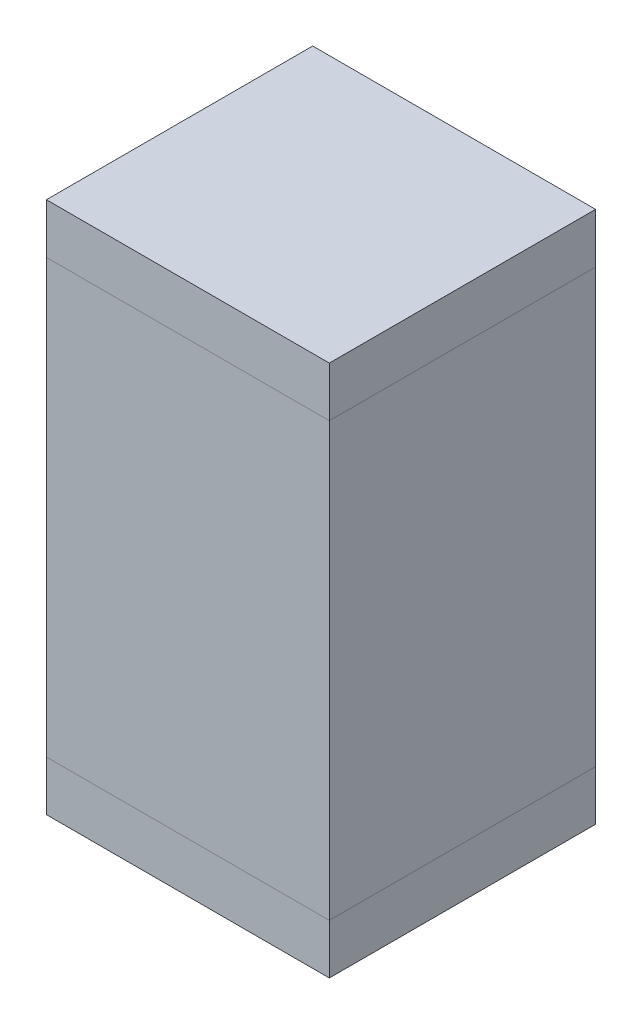
ISO-10303-21;
HEADER;
FILE_DESCRIPTION(('STEP AP214'),'2;1');
FILE_NAME('part.step','',(''),(''),'','','');
FILE_SCHEMA(('AUTOMOTIVE_DESIGN { 1 0 10303 214 1 1 1 1 }'));
ENDSEC;
DATA;
#1=APPLICATION_CONTEXT('core data for automotive mechanical design processes');
#2=APPLICATION_PROTOCOL_DEFINITION('international standard','automotive_design',2000,#1);
#3=PRODUCT_CONTEXT('',#1,'mechanical');
#4=PRODUCT('Part','Part','',(#3));
#5=PRODUCT_RELATED_PRODUCT_CATEGORY('part','',(#4));
#6=PRODUCT_DEFINITION_FORMATION('','',#4);
#7=PRODUCT_DEFINITION_CONTEXT('part definition',#1,'design');
#8=PRODUCT_DEFINITION('design','',#6,#7);
#9=PRODUCT_DEFINITION_SHAPE('','',#8);
#10=(LENGTH_UNIT() NAMED_UNIT(*) SI_UNIT(.MILLI.,.METRE.));
#11=(NAMED_UNIT(*) PLANE_ANGLE_UNIT() SI_UNIT($,.RADIAN.));
#12=(NAMED_UNIT(*) SI_UNIT($,.STERADIAN.) SOLID_ANGLE_UNIT());
#13=UNCERTAINTY_MEASURE_WITH_UNIT(LENGTH_MEASURE(1.E-05),#10,'distance_accuracy_value','');
#14=(GEOMETRIC_REPRESENTATION_CONTEXT(3) GLOBAL_UNCERTAINTY_ASSIGNED_CONTEXT((#13)) GLOBAL_UNIT_ASSIGNED_CONTEXT((#10,
#11,#12)) REPRESENTATION_CONTEXT('',''));
#15=CARTESIAN_POINT('',(0.,0.,0.));
#16=DIRECTION('',(0.,0.,1.));
#17=DIRECTION('',(1.,0.,0.));
#18=AXIS2_PLACEMENT_3D('',#15,#16,#17);
#19=CARTESIAN_POINT('',(0.,0.,0.));
#20=DIRECTION('',(0.,0.,1.));
#21=DIRECTION('',(1.,0.,0.));
#22=AXIS2_PLACEMENT_3D('',#19,#20,#21);
#23=PLANE('',#22);
#24=DIRECTION('',(1.,0.,0.));
#25=VECTOR('',#24,1.);
#26=CARTESIAN_POINT('',(-0.425,0.65,0.));
#27=LINE('',#26,#25);
#28=CARTESIAN_POINT('',(-0.425,0.65,0.));
#29=VERTEX_POINT('',#28);
#30=CARTESIAN_POINT('',(0.425,0.65,0.));
#31=VERTEX_POINT('',#30);
#32=EDGE_CURVE('P0_E26',#29,#31,#27,.T.);
#33=ORIENTED_EDGE('',*,*,#32,.T.);
#34=DIRECTION('',(0.,-1.,0.));
#35=VECTOR('',#34,1.);
#36=CARTESIAN_POINT('',(0.425,0.65,0.));
#37=LINE('',#36,#35);
#38=CARTESIAN_POINT('',(0.425,-0.65,0.));
#39=VERTEX_POINT('',#38);
#40=EDGE_CURVE('P0_E78',#31,#39,#37,.T.);
#41=ORIENTED_EDGE('',*,*,#40,.T.);
#42=DIRECTION('',(-1.,0.,0.));
#43=VECTOR('',#42,1.);
#44=CARTESIAN_POINT('',(0.425,-0.65,0.));
#45=LINE('',#44,#43);
#46=CARTESIAN_POINT('',(-0.425,-0.65,0.));
#47=VERTEX_POINT('',#46);
#48=EDGE_CURVE('P0_E106',#39,#47,#45,.T.);
#49=ORIENTED_EDGE('',*,*,#48,.T.);
#50=DIRECTION('',(0.,1.,0.));
#51=VECTOR('',#50,1.);
#52=CARTESIAN_POINT('',(-0.425,-0.65,0.));
#53=LINE('',#52,#51);
#54=EDGE_CURVE('P0_E53',#47,#29,#53,.T.);
#55=ORIENTED_EDGE('',*,*,#54,.T.);
#56=EDGE_LOOP('',(#33,#41,#49,#55));
#57=FACE_BOUND('',#56,.T.);
#58=ADVANCED_FACE('P0_F17',(#57),#23,.F.);
#59=CARTESIAN_POINT('',(0.,0.,0.8));
#60=DIRECTION('',(0.,0.,1.));
#61=DIRECTION('',(1.,0.,0.));
#62=AXIS2_PLACEMENT_3D('',#59,#60,#61);
#63=PLANE('',#62);
#64=DIRECTION('',(-1.,0.,0.));
#65=VECTOR('',#64,1.);
#66=CARTESIAN_POINT('',(-0.425,0.65,0.8));
#67=LINE('',#66,#65);
#68=CARTESIAN_POINT('',(0.425,0.65,0.8));
#69=VERTEX_POINT('',#68);
#70=CARTESIAN_POINT('',(-0.425,0.65,0.8));
#71=VERTEX_POINT('',#70);
#72=EDGE_CURVE('P0_E11',#69,#71,#67,.T.);
#73=ORIENTED_EDGE('',*,*,#72,.T.);
#74=DIRECTION('',(0.,-1.,0.));
#75=VECTOR('',#74,1.);
#76=CARTESIAN_POINT('',(-0.425,-0.65,0.8));
#77=LINE('',#76,#75);
#78=CARTESIAN_POINT('',(-0.425,-0.65,0.8));
#79=VERTEX_POINT('',#78);
#80=EDGE_CURVE('P0_E100',#71,#79,#77,.T.);
#81=ORIENTED_EDGE('',*,*,#80,.T.);
#82=DIRECTION('',(1.,0.,0.));
#83=VECTOR('',#82,1.);
#84=CARTESIAN_POINT('',(0.425,-0.65,0.8));
#85=LINE('',#84,#83);
#86=CARTESIAN_POINT('',(0.425,-0.65,0.8));
#87=VERTEX_POINT('',#86);
#88=EDGE_CURVE('P0_E60',#79,#87,#85,.T.);
#89=ORIENTED_EDGE('',*,*,#88,.T.);
#90=DIRECTION('',(0.,1.,0.));
#91=VECTOR('',#90,1.);
#92=CARTESIAN_POINT('',(0.425,0.65,0.8));
#93=LINE('',#92,#91);
#94=EDGE_CURVE('P0_E87',#87,#69,#93,.T.);
#95=ORIENTED_EDGE('',*,*,#94,.T.);
#96=EDGE_LOOP('',(#73,#81,#89,#95));
#97=FACE_BOUND('',#96,.T.);
#98=ADVANCED_FACE('P0_F117',(#97),#63,.T.);
#99=CARTESIAN_POINT('',(0.425,0.65,0.));
#100=DIRECTION('',(0.,1.,0.));
#101=DIRECTION('',(1.,0.,0.));
#102=AXIS2_PLACEMENT_3D('',#99,#100,#101);
#103=PLANE('',#102);
#104=ORIENTED_EDGE('',*,*,#32,.F.);
#105=DIRECTION('',(0.,0.,1.));
#106=VECTOR('',#105,1.);
#107=CARTESIAN_POINT('',(-0.425,0.65,0.));
#108=LINE('',#107,#106);
#109=EDGE_CURVE('P0_E80',#29,#71,#108,.T.);
#110=ORIENTED_EDGE('',*,*,#109,.T.);
#111=ORIENTED_EDGE('',*,*,#72,.F.);
#112=DIRECTION('',(0.,0.,1.));
#113=VECTOR('',#112,1.);
#114=CARTESIAN_POINT('',(0.425,0.65,0.));
#115=LINE('',#114,#113);
#116=EDGE_CURVE('P0_E82',#31,#69,#115,.T.);
#117=ORIENTED_EDGE('',*,*,#116,.F.);
#118=EDGE_LOOP('',(#104,#110,#111,#117));
#119=FACE_BOUND('',#118,.T.);
#120=ADVANCED_FACE('P0_F83',(#119),#103,.T.);
#121=CARTESIAN_POINT('',(-0.425,0.65,0.));
#122=DIRECTION('',(-1.,0.,0.));
#123=DIRECTION('',(0.,0.,1.));
#124=AXIS2_PLACEMENT_3D('',#121,#122,#123);
#125=PLANE('',#124);
#126=ORIENTED_EDGE('',*,*,#54,.F.);
#127=DIRECTION('',(0.,0.,1.));
#128=VECTOR('',#127,1.);
#129=CARTESIAN_POINT('',(-0.425,-0.65,0.));
#130=LINE('',#129,#128);
#131=EDGE_CURVE('P0_E101',#47,#79,#130,.T.);
#132=ORIENTED_EDGE('',*,*,#131,.T.);
#133=ORIENTED_EDGE('',*,*,#80,.F.);
#134=ORIENTED_EDGE('',*,*,#109,.F.);
#135=EDGE_LOOP('',(#126,#132,#133,#134));
#136=FACE_BOUND('',#135,.T.);
#137=ADVANCED_FACE('P0_F116',(#136),#125,.T.);
#138=CARTESIAN_POINT('',(-0.425,-0.65,0.));
#139=DIRECTION('',(0.,-1.,0.));
#140=DIRECTION('',(0.,0.,-1.));
#141=AXIS2_PLACEMENT_3D('',#138,#139,#140);
#142=PLANE('',#141);
#143=ORIENTED_EDGE('',*,*,#48,.F.);
#144=DIRECTION('',(0.,0.,1.));
#145=VECTOR('',#144,1.);
#146=CARTESIAN_POINT('',(0.425,-0.65,0.));
#147=LINE('',#146,#145);
#148=EDGE_CURVE('P0_E91',#39,#87,#147,.T.);
#149=ORIENTED_EDGE('',*,*,#148,.T.);
#150=ORIENTED_EDGE('',*,*,#88,.F.);
#151=ORIENTED_EDGE('',*,*,#131,.F.);
#152=EDGE_LOOP('',(#143,#149,#150,#151));
#153=FACE_BOUND('',#152,.T.);
#154=ADVANCED_FACE('P0_F128',(#153),#142,.T.);
#155=CARTESIAN_POINT('',(0.425,-0.65,0.));
#156=DIRECTION('',(1.,0.,0.));
#157=DIRECTION('',(0.,1.,0.));
#158=AXIS2_PLACEMENT_3D('',#155,#156,#157);
#159=PLANE('',#158);
#160=ORIENTED_EDGE('',*,*,#40,.F.);
#161=ORIENTED_EDGE('',*,*,#116,.T.);
#162=ORIENTED_EDGE('',*,*,#94,.F.);
#163=ORIENTED_EDGE('',*,*,#148,.F.);
#164=EDGE_LOOP('',(#160,#161,#162,#163));
#165=FACE_BOUND('',#164,.T.);
#166=ADVANCED_FACE('P0_F90',(#165),#159,.T.);
#167=CLOSED_SHELL('',(#58,#98,#120,#137,#154,#166));
#168=MANIFOLD_SOLID_BREP('P0_B1',#167);
#169=CARTESIAN_POINT('',(0.425,0.65,0.));
#170=DIRECTION('',(0.,1.,0.));
#171=DIRECTION('',(1.,0.,0.));
#172=AXIS2_PLACEMENT_3D('',#169,#170,#171);
#173=PLANE('',#172);
#174=DIRECTION('',(1.,0.,0.));
#175=VECTOR('',#174,1.);
#176=CARTESIAN_POINT('',(-0.425,0.65,0.));
#177=LINE('',#176,#175);
#178=CARTESIAN_POINT('',(-0.425,0.65,0.));
#179=VERTEX_POINT('',#178);
#180=CARTESIAN_POINT('',(0.425,0.65,0.));
#181=VERTEX_POINT('',#180);
#182=EDGE_CURVE('P1_E26',#179,#181,#177,.T.);
#183=ORIENTED_EDGE('',*,*,#182,.T.);
#184=DIRECTION('',(0.,0.,1.));
#185=VECTOR('',#184,1.);
#186=CARTESIAN_POINT('',(0.425,0.65,0.));
#187=LINE('',#186,#185);
#188=CARTESIAN_POINT('',(0.425,0.65,0.8));
#189=VERTEX_POINT('',#188);
#190=EDGE_CURVE('P1_E106',#181,#189,#187,.T.);
#191=ORIENTED_EDGE('',*,*,#190,.T.);
#192=DIRECTION('',(-1.,0.,0.));
#193=VECTOR('',#192,1.);
#194=CARTESIAN_POINT('',(-0.425,0.65,0.8));
#195=LINE('',#194,#193);
#196=CARTESIAN_POINT('',(-0.425,0.65,0.8));
#197=VERTEX_POINT('',#196);
#198=EDGE_CURVE('P1_E85',#189,#197,#195,.T.);
#199=ORIENTED_EDGE('',*,*,#198,.T.);
#200=DIRECTION('',(0.,0.,1.));
#201=VECTOR('',#200,1.);
#202=CARTESIAN_POINT('',(-0.425,0.65,0.));
#203=LINE('',#202,#201);
#204=EDGE_CURVE('P1_E60',#179,#197,#203,.T.);
#205=ORIENTED_EDGE('',*,*,#204,.F.);
#206=EDGE_LOOP('',(#183,#191,#199,#205));
#207=FACE_BOUND('',#206,.T.);
#208=ADVANCED_FACE('P1_F17',(#207),#173,.F.);
#209=CARTESIAN_POINT('',(0.425,0.8,0.));
#210=DIRECTION('',(0.,1.,0.));
#211=DIRECTION('',(1.,0.,0.));
#212=AXIS2_PLACEMENT_3D('',#209,#210,#211);
#213=PLANE('',#212);
#214=DIRECTION('',(-1.,0.,0.));
#215=VECTOR('',#214,1.);
#216=CARTESIAN_POINT('',(-0.425,0.8,0.));
#217=LINE('',#216,#215);
#218=CARTESIAN_POINT('',(0.425,0.8,0.));
#219=VERTEX_POINT('',#218);
#220=CARTESIAN_POINT('',(-0.425,0.8,0.));
#221=VERTEX_POINT('',#220);
#222=EDGE_CURVE('P1_E11',#219,#221,#217,.T.);
#223=ORIENTED_EDGE('',*,*,#222,.T.);
#224=DIRECTION('',(0.,0.,1.));
#225=VECTOR('',#224,1.);
#226=CARTESIAN_POINT('',(-0.425,0.8,0.));
#227=LINE('',#226,#225);
#228=CARTESIAN_POINT('',(-0.425,0.8,0.8));
#229=VERTEX_POINT('',#228);
#230=EDGE_CURVE('P1_E65',#221,#229,#227,.T.);
#231=ORIENTED_EDGE('',*,*,#230,.T.);
#232=DIRECTION('',(1.,0.,0.));
#233=VECTOR('',#232,1.);
#234=CARTESIAN_POINT('',(-0.425,0.8,0.8));
#235=LINE('',#234,#233);
#236=CARTESIAN_POINT('',(0.425,0.8,0.8));
#237=VERTEX_POINT('',#236);
#238=EDGE_CURVE('P1_E68',#229,#237,#235,.T.);
#239=ORIENTED_EDGE('',*,*,#238,.T.);
#240=DIRECTION('',(0.,0.,-1.));
#241=VECTOR('',#240,1.);
#242=CARTESIAN_POINT('',(0.425,0.8,0.));
#243=LINE('',#242,#241);
#244=EDGE_CURVE('P1_E110',#237,#219,#243,.T.);
#245=ORIENTED_EDGE('',*,*,#244,.T.);
#246=EDGE_LOOP('',(#223,#231,#239,#245));
#247=FACE_BOUND('',#246,.T.);
#248=ADVANCED_FACE('P1_F66',(#247),#213,.T.);
#249=CARTESIAN_POINT('',(0.425,0.65,0.));
#250=DIRECTION('',(0.,0.,-1.));
#251=DIRECTION('',(0.,-1.,0.));
#252=AXIS2_PLACEMENT_3D('',#249,#250,#251);
#253=PLANE('',#252);
#254=ORIENTED_EDGE('',*,*,#182,.F.);
#255=DIRECTION('',(0.,1.,0.));
#256=VECTOR('',#255,1.);
#257=CARTESIAN_POINT('',(-0.425,0.65,0.));
#258=LINE('',#257,#256);
#259=EDGE_CURVE('P1_E71',#179,#221,#258,.T.);
#260=ORIENTED_EDGE('',*,*,#259,.T.);
#261=ORIENTED_EDGE('',*,*,#222,.F.);
#262=DIRECTION('',(0.,1.,0.));
#263=VECTOR('',#262,1.);
#264=CARTESIAN_POINT('',(0.425,0.65,0.));
#265=LINE('',#264,#263);
#266=EDGE_CURVE('P1_E113',#181,#219,#265,.T.);
#267=ORIENTED_EDGE('',*,*,#266,.F.);
#268=EDGE_LOOP('',(#254,#260,#261,#267));
#269=FACE_BOUND('',#268,.T.);
#270=ADVANCED_FACE('P1_F100',(#269),#253,.T.);
#271=CARTESIAN_POINT('',(-0.425,0.65,0.));
#272=DIRECTION('',(-1.,0.,0.));
#273=DIRECTION('',(0.,0.,1.));
#274=AXIS2_PLACEMENT_3D('',#271,#272,#273);
#275=PLANE('',#274);
#276=ORIENTED_EDGE('',*,*,#204,.T.);
#277=DIRECTION('',(0.,1.,0.));
#278=VECTOR('',#277,1.);
#279=CARTESIAN_POINT('',(-0.425,0.65,0.8));
#280=LINE('',#279,#278);
#281=EDGE_CURVE('P1_E73',#197,#229,#280,.T.);
#282=ORIENTED_EDGE('',*,*,#281,.T.);
#283=ORIENTED_EDGE('',*,*,#230,.F.);
#284=ORIENTED_EDGE('',*,*,#259,.F.);
#285=EDGE_LOOP('',(#276,#282,#283,#284));
#286=FACE_BOUND('',#285,.T.);
#287=ADVANCED_FACE('P1_F74',(#286),#275,.T.);
#288=CARTESIAN_POINT('',(-0.425,0.65,0.8));
#289=DIRECTION('',(0.,0.,1.));
#290=DIRECTION('',(1.,0.,0.));
#291=AXIS2_PLACEMENT_3D('',#288,#289,#290);
#292=PLANE('',#291);
#293=ORIENTED_EDGE('',*,*,#198,.F.);
#294=DIRECTION('',(0.,1.,0.));
#295=VECTOR('',#294,1.);
#296=CARTESIAN_POINT('',(0.425,0.65,0.8));
#297=LINE('',#296,#295);
#298=EDGE_CURVE('P1_E82',#189,#237,#297,.T.);
#299=ORIENTED_EDGE('',*,*,#298,.T.);
#300=ORIENTED_EDGE('',*,*,#238,.F.);
#301=ORIENTED_EDGE('',*,*,#281,.F.);
#302=EDGE_LOOP('',(#293,#299,#300,#301));
#303=FACE_BOUND('',#302,.T.);
#304=ADVANCED_FACE('P1_F80',(#303),#292,.T.);
#305=CARTESIAN_POINT('',(0.425,0.65,0.8));
#306=DIRECTION('',(1.,0.,0.));
#307=DIRECTION('',(0.,1.,0.));
#308=AXIS2_PLACEMENT_3D('',#305,#306,#307);
#309=PLANE('',#308);
#310=ORIENTED_EDGE('',*,*,#190,.F.);
#311=ORIENTED_EDGE('',*,*,#266,.T.);
#312=ORIENTED_EDGE('',*,*,#244,.F.);
#313=ORIENTED_EDGE('',*,*,#298,.F.);
#314=EDGE_LOOP('',(#310,#311,#312,#313));
#315=FACE_BOUND('',#314,.T.);
#316=ADVANCED_FACE('P1_F108',(#315),#309,.T.);
#317=CLOSED_SHELL('',(#208,#248,#270,#287,#304,#316));
#318=MANIFOLD_SOLID_BREP('P1_B1',#317);
#319=CARTESIAN_POINT('',(-0.425,-0.65,0.));
#320=DIRECTION('',(0.,-1.,0.));
#321=DIRECTION('',(0.,0.,-1.));
#322=AXIS2_PLACEMENT_3D('',#319,#320,#321);
#323=PLANE('',#322);
#324=DIRECTION('',(-1.,0.,0.));
#325=VECTOR('',#324,1.);
#326=CARTESIAN_POINT('',(0.425,-0.65,0.));
#327=LINE('',#326,#325);
#328=CARTESIAN_POINT('',(0.425,-0.65,0.));
#329=VERTEX_POINT('',#328);
#330=CARTESIAN_POINT('',(-0.425,-0.65,0.));
#331=VERTEX_POINT('',#330);
#332=EDGE_CURVE('P2_E25',#329,#331,#327,.T.);
#333=ORIENTED_EDGE('',*,*,#332,.T.);
#334=DIRECTION('',(0.,0.,1.));
#335=VECTOR('',#334,1.);
#336=CARTESIAN_POINT('',(-0.425,-0.65,0.));
#337=LINE('',#336,#335);
#338=CARTESIAN_POINT('',(-0.425,-0.65,0.8));
#339=VERTEX_POINT('',#338);
#340=EDGE_CURVE('P2_E71',#331,#339,#337,.T.);
#341=ORIENTED_EDGE('',*,*,#340,.T.);
#342=DIRECTION('',(1.,0.,0.));
#343=VECTOR('',#342,1.);
#344=CARTESIAN_POINT('',(0.425,-0.65,0.8));
#345=LINE('',#344,#343);
#346=CARTESIAN_POINT('',(0.425,-0.65,0.8));
#347=VERTEX_POINT('',#346);
#348=EDGE_CURVE('P2_E92',#339,#347,#345,.T.);
#349=ORIENTED_EDGE('',*,*,#348,.T.);
#350=DIRECTION('',(0.,0.,1.));
#351=VECTOR('',#350,1.);
#352=CARTESIAN_POINT('',(0.425,-0.65,0.));
#353=LINE('',#352,#351);
#354=EDGE_CURVE('P2_E72',#329,#347,#353,.T.);
#355=ORIENTED_EDGE('',*,*,#354,.F.);
#356=EDGE_LOOP('',(#333,#341,#349,#355));
#357=FACE_BOUND('',#356,.T.);
#358=ADVANCED_FACE('P2_F17',(#357),#323,.F.);
#359=CARTESIAN_POINT('',(-0.425,-0.8,0.));
#360=DIRECTION('',(0.,-1.,0.));
#361=DIRECTION('',(0.,0.,-1.));
#362=AXIS2_PLACEMENT_3D('',#359,#360,#361);
#363=PLANE('',#362);
#364=DIRECTION('',(1.,0.,0.));
#365=VECTOR('',#364,1.);
#366=CARTESIAN_POINT('',(0.425,-0.8,0.));
#367=LINE('',#366,#365);
#368=CARTESIAN_POINT('',(-0.425,-0.8,0.));
#369=VERTEX_POINT('',#368);
#370=CARTESIAN_POINT('',(0.425,-0.8,0.));
#371=VERTEX_POINT('',#370);
#372=EDGE_CURVE('P2_E11',#369,#371,#367,.T.);
#373=ORIENTED_EDGE('',*,*,#372,.T.);
#374=DIRECTION('',(0.,0.,1.));
#375=VECTOR('',#374,1.);
#376=CARTESIAN_POINT('',(0.425,-0.8,0.));
#377=LINE('',#376,#375);
#378=CARTESIAN_POINT('',(0.425,-0.8,0.8));
#379=VERTEX_POINT('',#378);
#380=EDGE_CURVE('P2_E97',#371,#379,#377,.T.);
#381=ORIENTED_EDGE('',*,*,#380,.T.);
#382=DIRECTION('',(-1.,0.,0.));
#383=VECTOR('',#382,1.);
#384=CARTESIAN_POINT('',(0.425,-0.8,0.8));
#385=LINE('',#384,#383);
#386=CARTESIAN_POINT('',(-0.425,-0.8,0.8));
#387=VERTEX_POINT('',#386);
#388=EDGE_CURVE('P2_E93',#379,#387,#385,.T.);
#389=ORIENTED_EDGE('',*,*,#388,.T.);
#390=DIRECTION('',(0.,0.,-1.));
#391=VECTOR('',#390,1.);
#392=CARTESIAN_POINT('',(-0.425,-0.8,0.));
#393=LINE('',#392,#391);
#394=EDGE_CURVE('P2_E81',#387,#369,#393,.T.);
#395=ORIENTED_EDGE('',*,*,#394,.T.);
#396=EDGE_LOOP('',(#373,#381,#389,#395));
#397=FACE_BOUND('',#396,.T.);
#398=ADVANCED_FACE('P2_F117',(#397),#363,.T.);
#399=CARTESIAN_POINT('',(-0.425,-0.65,0.));
#400=DIRECTION('',(0.,0.,-1.));
#401=DIRECTION('',(0.,-1.,0.));
#402=AXIS2_PLACEMENT_3D('',#399,#400,#401);
#403=PLANE('',#402);
#404=ORIENTED_EDGE('',*,*,#332,.F.);
#405=DIRECTION('',(0.,-1.,0.));
#406=VECTOR('',#405,1.);
#407=CARTESIAN_POINT('',(0.425,-0.65,0.));
#408=LINE('',#407,#406);
#409=EDGE_CURVE('P2_E74',#329,#371,#408,.T.);
#410=ORIENTED_EDGE('',*,*,#409,.T.);
#411=ORIENTED_EDGE('',*,*,#372,.F.);
#412=DIRECTION('',(0.,-1.,0.));
#413=VECTOR('',#412,1.);
#414=CARTESIAN_POINT('',(-0.425,-0.65,0.));
#415=LINE('',#414,#413);
#416=EDGE_CURVE('P2_E76',#331,#369,#415,.T.);
#417=ORIENTED_EDGE('',*,*,#416,.F.);
#418=EDGE_LOOP('',(#404,#410,#411,#417));
#419=FACE_BOUND('',#418,.T.);
#420=ADVANCED_FACE('P2_F77',(#419),#403,.T.);
#421=CARTESIAN_POINT('',(0.425,-0.65,0.));
#422=DIRECTION('',(1.,0.,0.));
#423=DIRECTION('',(0.,1.,0.));
#424=AXIS2_PLACEMENT_3D('',#421,#422,#423);
#425=PLANE('',#424);
#426=ORIENTED_EDGE('',*,*,#354,.T.);
#427=DIRECTION('',(0.,-1.,0.));
#428=VECTOR('',#427,1.);
#429=CARTESIAN_POINT('',(0.425,-0.65,0.8));
#430=LINE('',#429,#428);
#431=EDGE_CURVE('P2_E102',#347,#379,#430,.T.);
#432=ORIENTED_EDGE('',*,*,#431,.T.);
#433=ORIENTED_EDGE('',*,*,#380,.F.);
#434=ORIENTED_EDGE('',*,*,#409,.F.);
#435=EDGE_LOOP('',(#426,#432,#433,#434));
#436=FACE_BOUND('',#435,.T.);
#437=ADVANCED_FACE('P2_F114',(#436),#425,.T.);
#438=CARTESIAN_POINT('',(0.425,-0.65,0.8));
#439=DIRECTION('',(0.,0.,1.));
#440=DIRECTION('',(1.,0.,0.));
#441=AXIS2_PLACEMENT_3D('',#438,#439,#440);
#442=PLANE('',#441);
#443=ORIENTED_EDGE('',*,*,#348,.F.);
#444=DIRECTION('',(0.,-1.,0.));
#445=VECTOR('',#444,1.);
#446=CARTESIAN_POINT('',(-0.425,-0.65,0.8));
#447=LINE('',#446,#445);
#448=EDGE_CURVE('P2_E86',#339,#387,#447,.T.);
#449=ORIENTED_EDGE('',*,*,#448,.T.);
#450=ORIENTED_EDGE('',*,*,#388,.F.);
#451=ORIENTED_EDGE('',*,*,#431,.F.);
#452=EDGE_LOOP('',(#443,#449,#450,#451));
#453=FACE_BOUND('',#452,.T.);
#454=ADVANCED_FACE('P2_F119',(#453),#442,.T.);
#455=CARTESIAN_POINT('',(-0.425,-0.65,0.8));
#456=DIRECTION('',(-1.,0.,0.));
#457=DIRECTION('',(0.,0.,1.));
#458=AXIS2_PLACEMENT_3D('',#455,#456,#457);
#459=PLANE('',#458);
#460=ORIENTED_EDGE('',*,*,#340,.F.);
#461=ORIENTED_EDGE('',*,*,#416,.T.);
#462=ORIENTED_EDGE('',*,*,#394,.F.);
#463=ORIENTED_EDGE('',*,*,#448,.F.);
#464=EDGE_LOOP('',(#460,#461,#462,#463));
#465=FACE_BOUND('',#464,.T.);
#466=ADVANCED_FACE('P2_F84',(#465),#459,.T.);
#467=CLOSED_SHELL('',(#358,#398,#420,#437,#454,#466));
#468=MANIFOLD_SOLID_BREP('P2_B1',#467);
#469=ADVANCED_BREP_SHAPE_REPRESENTATION('',(#18,#168,#318,#468),#14);
#470=SHAPE_DEFINITION_REPRESENTATION(#9,#469);
ENDSEC;
END-ISO-10303-21;
